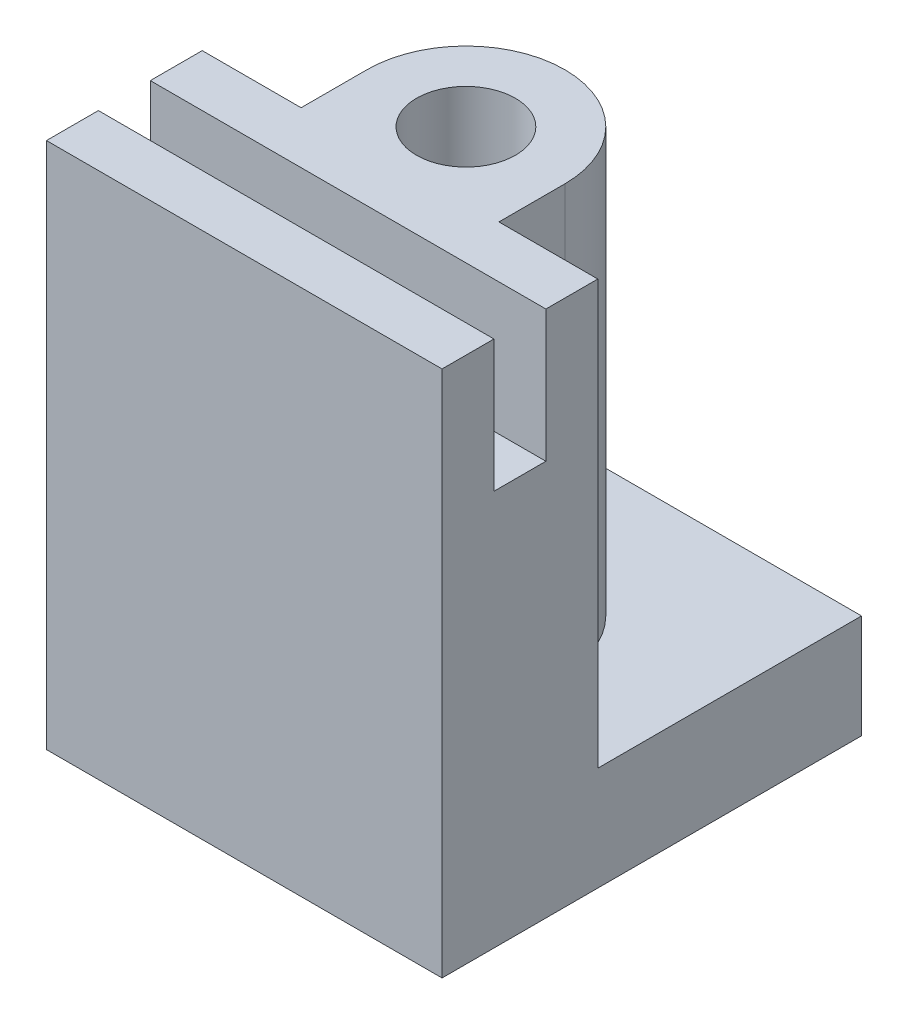
ISO-10303-21;
HEADER;
FILE_DESCRIPTION(('STEP AP214'),'2;1');
FILE_NAME('part.step','',(''),(''),'','','');
FILE_SCHEMA(('AUTOMOTIVE_DESIGN { 1 0 10303 214 1 1 1 1 }'));
ENDSEC;
DATA;
#1=APPLICATION_CONTEXT('core data for automotive mechanical design processes');
#2=APPLICATION_PROTOCOL_DEFINITION('international standard','automotive_design',2000,#1);
#3=PRODUCT_CONTEXT('',#1,'mechanical');
#4=PRODUCT('Part','Part','',(#3));
#5=PRODUCT_RELATED_PRODUCT_CATEGORY('part','',(#4));
#6=PRODUCT_DEFINITION_FORMATION('','',#4);
#7=PRODUCT_DEFINITION_CONTEXT('part definition',#1,'design');
#8=PRODUCT_DEFINITION('design','',#6,#7);
#9=PRODUCT_DEFINITION_SHAPE('','',#8);
#10=(LENGTH_UNIT() NAMED_UNIT(*) SI_UNIT(.MILLI.,.METRE.));
#11=(NAMED_UNIT(*) PLANE_ANGLE_UNIT() SI_UNIT($,.RADIAN.));
#12=(NAMED_UNIT(*) SI_UNIT($,.STERADIAN.) SOLID_ANGLE_UNIT());
#13=UNCERTAINTY_MEASURE_WITH_UNIT(LENGTH_MEASURE(1.E-05),#10,'distance_accuracy_value','');
#14=(GEOMETRIC_REPRESENTATION_CONTEXT(3) GLOBAL_UNCERTAINTY_ASSIGNED_CONTEXT((#13)) GLOBAL_UNIT_ASSIGNED_CONTEXT((#10,
#11,#12)) REPRESENTATION_CONTEXT('',''));
#15=CARTESIAN_POINT('',(0.,0.,0.));
#16=DIRECTION('',(0.,0.,1.));
#17=DIRECTION('',(1.,0.,0.));
#18=AXIS2_PLACEMENT_3D('',#15,#16,#17);
#19=CARTESIAN_POINT('',(38.1,9.99999999999999,-15.));
#20=DIRECTION('',(0.,0.,1.));
#21=DIRECTION('',(0.,-1.,0.));
#22=AXIS2_PLACEMENT_3D('',#19,#20,#21);
#23=PLANE('',#22);
#24=DIRECTION('',(-1.,0.,0.));
#25=VECTOR('',#24,1.);
#26=CARTESIAN_POINT('',(38.1,9.99999999999999,-15.));
#27=LINE('',#26,#25);
#28=CARTESIAN_POINT('',(38.1,9.99999999999999,-15.));
#29=VERTEX_POINT('',#28);
#30=CARTESIAN_POINT('',(28.575,9.99999999999998,-15.));
#31=VERTEX_POINT('',#30);
#32=EDGE_CURVE('E206',#29,#31,#27,.T.);
#33=ORIENTED_EDGE('',*,*,#32,.T.);
#34=DIRECTION('',(0.,1.,0.));
#35=VECTOR('',#34,1.);
#36=CARTESIAN_POINT('',(28.575,-0.002000000000002,-15.));
#37=LINE('',#36,#35);
#38=CARTESIAN_POINT('',(28.575,50.8,-15.));
#39=VERTEX_POINT('',#38);
#40=EDGE_CURVE('E270',#31,#39,#37,.T.);
#41=ORIENTED_EDGE('',*,*,#40,.T.);
#42=DIRECTION('',(-1.,0.,0.));
#43=VECTOR('',#42,1.);
#44=CARTESIAN_POINT('',(38.1,50.8,-15.));
#45=LINE('',#44,#43);
#46=CARTESIAN_POINT('',(38.1,50.8,-15.));
#47=VERTEX_POINT('',#46);
#48=EDGE_CURVE('E202',#47,#39,#45,.T.);
#49=ORIENTED_EDGE('',*,*,#48,.F.);
#50=DIRECTION('',(0.,1.,0.));
#51=VECTOR('',#50,1.);
#52=CARTESIAN_POINT('',(38.1,9.99999999999999,-15.));
#53=LINE('',#52,#51);
#54=EDGE_CURVE('E237',#29,#47,#53,.T.);
#55=ORIENTED_EDGE('',*,*,#54,.F.);
#56=EDGE_LOOP('',(#33,#41,#49,#55));
#57=FACE_BOUND('',#56,.T.);
#58=ADVANCED_FACE('F52',(#57),#23,.F.);
#59=CARTESIAN_POINT('',(38.1,50.8,0.));
#60=DIRECTION('',(0.,0.,-1.));
#61=DIRECTION('',(0.,1.,0.));
#62=AXIS2_PLACEMENT_3D('',#59,#60,#61);
#63=PLANE('',#62);
#64=DIRECTION('',(0.,-1.,0.));
#65=VECTOR('',#64,1.);
#66=CARTESIAN_POINT('',(0.,50.8,0.));
#67=LINE('',#66,#65);
#68=CARTESIAN_POINT('',(0.,50.8,0.));
#69=VERTEX_POINT('',#68);
#70=CARTESIAN_POINT('',(0.,0.,0.));
#71=VERTEX_POINT('',#70);
#72=EDGE_CURVE('E172',#69,#71,#67,.T.);
#73=ORIENTED_EDGE('',*,*,#72,.T.);
#74=DIRECTION('',(-1.,0.,0.));
#75=VECTOR('',#74,1.);
#76=CARTESIAN_POINT('',(38.1,0.,0.));
#77=LINE('',#76,#75);
#78=CARTESIAN_POINT('',(38.1,0.,0.));
#79=VERTEX_POINT('',#78);
#80=EDGE_CURVE('E60',#79,#71,#77,.T.);
#81=ORIENTED_EDGE('',*,*,#80,.F.);
#82=DIRECTION('',(0.,-1.,0.));
#83=VECTOR('',#82,1.);
#84=CARTESIAN_POINT('',(38.1,50.8,0.));
#85=LINE('',#84,#83);
#86=CARTESIAN_POINT('',(38.1,50.8,0.));
#87=VERTEX_POINT('',#86);
#88=EDGE_CURVE('E194',#87,#79,#85,.T.);
#89=ORIENTED_EDGE('',*,*,#88,.F.);
#90=DIRECTION('',(-1.,0.,0.));
#91=VECTOR('',#90,1.);
#92=CARTESIAN_POINT('',(38.1,50.8,0.));
#93=LINE('',#92,#91);
#94=EDGE_CURVE('E168',#87,#69,#93,.T.);
#95=ORIENTED_EDGE('',*,*,#94,.T.);
#96=EDGE_LOOP('',(#73,#81,#89,#95));
#97=FACE_BOUND('',#96,.T.);
#98=ADVANCED_FACE('F54',(#97),#63,.F.);
#99=CARTESIAN_POINT('',(38.1,0.,0.));
#100=DIRECTION('',(0.,1.,0.));
#101=DIRECTION('',(0.,0.,1.));
#102=AXIS2_PLACEMENT_3D('',#99,#100,#101);
#103=PLANE('',#102);
#104=DIRECTION('',(0.,0.,-1.));
#105=VECTOR('',#104,1.);
#106=CARTESIAN_POINT('',(0.,0.,0.));
#107=LINE('',#106,#105);
#108=CARTESIAN_POINT('',(0.,0.,-40.4));
#109=VERTEX_POINT('',#108);
#110=EDGE_CURVE('E175',#71,#109,#107,.T.);
#111=ORIENTED_EDGE('',*,*,#110,.T.);
#112=DIRECTION('',(-1.,0.,0.));
#113=VECTOR('',#112,1.);
#114=CARTESIAN_POINT('',(38.1,0.,-40.4));
#115=LINE('',#114,#113);
#116=CARTESIAN_POINT('',(38.1,0.,-40.4));
#117=VERTEX_POINT('',#116);
#118=EDGE_CURVE('E212',#117,#109,#115,.T.);
#119=ORIENTED_EDGE('',*,*,#118,.F.);
#120=DIRECTION('',(0.,0.,-1.));
#121=VECTOR('',#120,1.);
#122=CARTESIAN_POINT('',(38.1,0.,0.));
#123=LINE('',#122,#121);
#124=EDGE_CURVE('E123',#79,#117,#123,.T.);
#125=ORIENTED_EDGE('',*,*,#124,.F.);
#126=ORIENTED_EDGE('',*,*,#80,.T.);
#127=EDGE_LOOP('',(#111,#119,#125,#126));
#128=FACE_BOUND('',#127,.T.);
#129=ADVANCED_FACE('F215',(#128),#103,.F.);
#130=CARTESIAN_POINT('',(38.1,0.,-40.4));
#131=DIRECTION('',(0.,0.,1.));
#132=DIRECTION('',(1.,0.,0.));
#133=AXIS2_PLACEMENT_3D('',#130,#131,#132);
#134=PLANE('',#133);
#135=DIRECTION('',(0.,1.,0.));
#136=VECTOR('',#135,1.);
#137=CARTESIAN_POINT('',(0.,0.,-40.4));
#138=LINE('',#137,#136);
#139=CARTESIAN_POINT('',(0.,9.99999999999999,-40.4));
#140=VERTEX_POINT('',#139);
#141=EDGE_CURVE('E178',#109,#140,#138,.T.);
#142=ORIENTED_EDGE('',*,*,#141,.T.);
#143=DIRECTION('',(-1.,0.,0.));
#144=VECTOR('',#143,1.);
#145=CARTESIAN_POINT('',(38.1,9.99999999999999,-40.4));
#146=LINE('',#145,#144);
#147=CARTESIAN_POINT('',(38.1,9.99999999999999,-40.4));
#148=VERTEX_POINT('',#147);
#149=EDGE_CURVE('E209',#148,#140,#146,.T.);
#150=ORIENTED_EDGE('',*,*,#149,.F.);
#151=DIRECTION('',(0.,1.,0.));
#152=VECTOR('',#151,1.);
#153=CARTESIAN_POINT('',(38.1,0.,-40.4));
#154=LINE('',#153,#152);
#155=EDGE_CURVE('E238',#117,#148,#154,.T.);
#156=ORIENTED_EDGE('',*,*,#155,.F.);
#157=ORIENTED_EDGE('',*,*,#118,.T.);
#158=EDGE_LOOP('',(#142,#150,#156,#157));
#159=FACE_BOUND('',#158,.T.);
#160=ADVANCED_FACE('F226',(#159),#134,.F.);
#161=CARTESIAN_POINT('',(38.1,9.99999999999999,-40.4));
#162=DIRECTION('',(0.,-1.,0.));
#163=DIRECTION('',(0.,0.,-1.));
#164=AXIS2_PLACEMENT_3D('',#161,#162,#163);
#165=PLANE('',#164);
#166=CARTESIAN_POINT('',(19.05,9.99999999999999,-21.35));
#167=DIRECTION('',(0.,-1.,0.));
#168=DIRECTION('',(0.,0.,-1.));
#169=AXIS2_PLACEMENT_3D('',#166,#167,#168);
#170=CIRCLE('',#169,9.525);
#171=CARTESIAN_POINT('',(28.575,9.99999999999998,-21.35));
#172=VERTEX_POINT('',#171);
#173=CARTESIAN_POINT('',(9.525,9.99999999999998,-21.35));
#174=VERTEX_POINT('',#173);
#175=EDGE_CURVE('E176',#172,#174,#170,.F.);
#176=ORIENTED_EDGE('',*,*,#175,.F.);
#177=DIRECTION('',(0.,0.,-1.));
#178=VECTOR('',#177,1.);
#179=CARTESIAN_POINT('',(28.575,9.99999999999999,-15.));
#180=LINE('',#179,#178);
#181=EDGE_CURVE('E260',#31,#172,#180,.T.);
#182=ORIENTED_EDGE('',*,*,#181,.F.);
#183=ORIENTED_EDGE('',*,*,#32,.F.);
#184=DIRECTION('',(0.,0.,1.));
#185=VECTOR('',#184,1.);
#186=CARTESIAN_POINT('',(38.1,9.99999999999999,-40.4));
#187=LINE('',#186,#185);
#188=EDGE_CURVE('E234',#148,#29,#187,.T.);
#189=ORIENTED_EDGE('',*,*,#188,.F.);
#190=ORIENTED_EDGE('',*,*,#149,.T.);
#191=DIRECTION('',(0.,0.,1.));
#192=VECTOR('',#191,1.);
#193=CARTESIAN_POINT('',(0.,9.99999999999999,-40.4));
#194=LINE('',#193,#192);
#195=CARTESIAN_POINT('',(0.,9.99999999999999,-15.));
#196=VERTEX_POINT('',#195);
#197=EDGE_CURVE('E180',#140,#196,#194,.T.);
#198=ORIENTED_EDGE('',*,*,#197,.T.);
#199=CARTESIAN_POINT('',(9.525,9.99999999999998,-15.));
#200=VERTEX_POINT('',#199);
#201=EDGE_CURVE('E205',#200,#196,#27,.T.);
#202=ORIENTED_EDGE('',*,*,#201,.F.);
#203=DIRECTION('',(0.,0.,1.));
#204=VECTOR('',#203,1.);
#205=CARTESIAN_POINT('',(9.525,9.99999999999999,-21.35));
#206=LINE('',#205,#204);
#207=EDGE_CURVE('E257',#174,#200,#206,.T.);
#208=ORIENTED_EDGE('',*,*,#207,.F.);
#209=EDGE_LOOP('',(#176,#182,#183,#189,#190,#198,#202,#208));
#210=FACE_BOUND('',#209,.T.);
#211=ADVANCED_FACE('F231',(#210),#165,.F.);
#212=CARTESIAN_POINT('',(9.52500000000001,50.8,-15.));
#213=VERTEX_POINT('',#212);
#214=CARTESIAN_POINT('',(0.,50.8,-15.));
#215=VERTEX_POINT('',#214);
#216=EDGE_CURVE('E201',#213,#215,#45,.T.);
#217=ORIENTED_EDGE('',*,*,#216,.F.);
#218=DIRECTION('',(0.,1.,0.));
#219=VECTOR('',#218,1.);
#220=CARTESIAN_POINT('',(9.525,-0.002000000000002,-15.));
#221=LINE('',#220,#219);
#222=EDGE_CURVE('E268',#200,#213,#221,.T.);
#223=ORIENTED_EDGE('',*,*,#222,.F.);
#224=ORIENTED_EDGE('',*,*,#201,.T.);
#225=DIRECTION('',(0.,1.,0.));
#226=VECTOR('',#225,1.);
#227=CARTESIAN_POINT('',(0.,9.99999999999999,-15.));
#228=LINE('',#227,#226);
#229=EDGE_CURVE('E183',#196,#215,#228,.T.);
#230=ORIENTED_EDGE('',*,*,#229,.T.);
#231=EDGE_LOOP('',(#217,#223,#224,#230));
#232=FACE_BOUND('',#231,.T.);
#233=ADVANCED_FACE('F289',(#232),#23,.F.);
#234=CARTESIAN_POINT('',(38.1,50.8,-15.));
#235=DIRECTION('',(0.,-1.,0.));
#236=DIRECTION('',(0.,0.,-1.));
#237=AXIS2_PLACEMENT_3D('',#234,#235,#236);
#238=PLANE('',#237);
#239=DIRECTION('',(0.,0.,1.));
#240=VECTOR('',#239,1.);
#241=CARTESIAN_POINT('',(0.,50.8,-15.));
#242=LINE('',#241,#240);
#243=CARTESIAN_POINT('',(0.,50.8,-10.));
#244=VERTEX_POINT('',#243);
#245=EDGE_CURVE('E186',#215,#244,#242,.T.);
#246=ORIENTED_EDGE('',*,*,#245,.T.);
#247=DIRECTION('',(-1.,0.,0.));
#248=VECTOR('',#247,1.);
#249=CARTESIAN_POINT('',(38.1,50.8,-10.));
#250=LINE('',#249,#248);
#251=CARTESIAN_POINT('',(38.1,50.8,-10.));
#252=VERTEX_POINT('',#251);
#253=EDGE_CURVE('E198',#252,#244,#250,.T.);
#254=ORIENTED_EDGE('',*,*,#253,.F.);
#255=DIRECTION('',(0.,0.,1.));
#256=VECTOR('',#255,1.);
#257=CARTESIAN_POINT('',(38.1,50.8,-15.));
#258=LINE('',#257,#256);
#259=EDGE_CURVE('E240',#47,#252,#258,.T.);
#260=ORIENTED_EDGE('',*,*,#259,.F.);
#261=ORIENTED_EDGE('',*,*,#48,.T.);
#262=DIRECTION('',(0.,0.,-1.));
#263=VECTOR('',#262,1.);
#264=CARTESIAN_POINT('',(28.575,50.8,-15.));
#265=LINE('',#264,#263);
#266=CARTESIAN_POINT('',(28.575,50.8,-21.35));
#267=VERTEX_POINT('',#266);
#268=EDGE_CURVE('E279',#39,#267,#265,.T.);
#269=ORIENTED_EDGE('',*,*,#268,.T.);
#270=CARTESIAN_POINT('',(19.05,50.8,-21.35));
#271=DIRECTION('',(0.,1.,0.));
#272=DIRECTION('',(0.,0.,-1.));
#273=AXIS2_PLACEMENT_3D('',#270,#271,#272);
#274=CIRCLE('',#273,9.525);
#275=CARTESIAN_POINT('',(9.525,50.8,-21.35));
#276=VERTEX_POINT('',#275);
#277=EDGE_CURVE('E277',#267,#276,#274,.T.);
#278=ORIENTED_EDGE('',*,*,#277,.T.);
#279=DIRECTION('',(0.,0.,1.));
#280=VECTOR('',#279,1.);
#281=CARTESIAN_POINT('',(9.525,50.8,-21.35));
#282=LINE('',#281,#280);
#283=EDGE_CURVE('E67',#276,#213,#282,.T.);
#284=ORIENTED_EDGE('',*,*,#283,.T.);
#285=ORIENTED_EDGE('',*,*,#216,.T.);
#286=EDGE_LOOP('',(#246,#254,#260,#261,#269,#278,#284,#285));
#287=FACE_BOUND('',#286,.T.);
#288=CARTESIAN_POINT('',(19.05,50.8,-21.35));
#289=DIRECTION('',(0.,1.,0.));
#290=DIRECTION('',(0.,0.,1.));
#291=AXIS2_PLACEMENT_3D('',#288,#289,#290);
#292=CIRCLE('',#291,4.7625);
#293=CARTESIAN_POINT('',(19.05,50.8,-16.5875));
#294=VERTEX_POINT('',#293);
#295=EDGE_CURVE('E276',#294,#294,#292,.T.);
#296=ORIENTED_EDGE('',*,*,#295,.F.);
#297=EDGE_LOOP('',(#296));
#298=FACE_BOUND('',#297,.T.);
#299=ADVANCED_FACE('F248',(#287,#298),#238,.F.);
#300=CARTESIAN_POINT('',(38.1,50.8,-10.));
#301=DIRECTION('',(0.,0.,-1.));
#302=DIRECTION('',(0.,1.,0.));
#303=AXIS2_PLACEMENT_3D('',#300,#301,#302);
#304=PLANE('',#303);
#305=DIRECTION('',(0.,-1.,0.));
#306=VECTOR('',#305,1.);
#307=CARTESIAN_POINT('',(0.,50.8,-10.));
#308=LINE('',#307,#306);
#309=CARTESIAN_POINT('',(0.,38.1,-9.99999999999999));
#310=VERTEX_POINT('',#309);
#311=EDGE_CURVE('E188',#244,#310,#308,.T.);
#312=ORIENTED_EDGE('',*,*,#311,.T.);
#313=DIRECTION('',(-1.,0.,0.));
#314=VECTOR('',#313,1.);
#315=CARTESIAN_POINT('',(38.1,38.1,-9.99999999999999));
#316=LINE('',#315,#314);
#317=CARTESIAN_POINT('',(38.1,38.1,-9.99999999999999));
#318=VERTEX_POINT('',#317);
#319=EDGE_CURVE('E163',#318,#310,#316,.T.);
#320=ORIENTED_EDGE('',*,*,#319,.F.);
#321=DIRECTION('',(0.,-1.,0.));
#322=VECTOR('',#321,1.);
#323=CARTESIAN_POINT('',(38.1,50.8,-10.));
#324=LINE('',#323,#322);
#325=EDGE_CURVE('E151',#252,#318,#324,.T.);
#326=ORIENTED_EDGE('',*,*,#325,.F.);
#327=ORIENTED_EDGE('',*,*,#253,.T.);
#328=EDGE_LOOP('',(#312,#320,#326,#327));
#329=FACE_BOUND('',#328,.T.);
#330=ADVANCED_FACE('F253',(#329),#304,.F.);
#331=CARTESIAN_POINT('',(38.1,38.1,-9.99999999999999));
#332=DIRECTION('',(0.,-1.,0.));
#333=DIRECTION('',(0.,0.,-1.));
#334=AXIS2_PLACEMENT_3D('',#331,#332,#333);
#335=PLANE('',#334);
#336=DIRECTION('',(0.,0.,1.));
#337=VECTOR('',#336,1.);
#338=CARTESIAN_POINT('',(0.,38.1,-9.99999999999999));
#339=LINE('',#338,#337);
#340=CARTESIAN_POINT('',(0.,38.1,-4.99999999999999));
#341=VERTEX_POINT('',#340);
#342=EDGE_CURVE('E160',#310,#341,#339,.T.);
#343=ORIENTED_EDGE('',*,*,#342,.T.);
#344=DIRECTION('',(-1.,0.,0.));
#345=VECTOR('',#344,1.);
#346=CARTESIAN_POINT('',(38.1,38.1,-4.99999999999999));
#347=LINE('',#346,#345);
#348=CARTESIAN_POINT('',(38.1,38.1,-4.99999999999999));
#349=VERTEX_POINT('',#348);
#350=EDGE_CURVE('E157',#349,#341,#347,.T.);
#351=ORIENTED_EDGE('',*,*,#350,.F.);
#352=DIRECTION('',(0.,0.,1.));
#353=VECTOR('',#352,1.);
#354=CARTESIAN_POINT('',(38.1,38.1,-9.99999999999999));
#355=LINE('',#354,#353);
#356=EDGE_CURVE('E144',#318,#349,#355,.T.);
#357=ORIENTED_EDGE('',*,*,#356,.F.);
#358=ORIENTED_EDGE('',*,*,#319,.T.);
#359=EDGE_LOOP('',(#343,#351,#357,#358));
#360=FACE_BOUND('',#359,.T.);
#361=ADVANCED_FACE('F158',(#360),#335,.F.);
#362=CARTESIAN_POINT('',(38.1,38.1,-4.99999999999999));
#363=DIRECTION('',(0.,0.,1.));
#364=DIRECTION('',(0.,-1.,0.));
#365=AXIS2_PLACEMENT_3D('',#362,#363,#364);
#366=PLANE('',#365);
#367=DIRECTION('',(0.,1.,0.));
#368=VECTOR('',#367,1.);
#369=CARTESIAN_POINT('',(0.,38.1,-4.99999999999999));
#370=LINE('',#369,#368);
#371=CARTESIAN_POINT('',(0.,50.8,-4.99999999999999));
#372=VERTEX_POINT('',#371);
#373=EDGE_CURVE('E191',#341,#372,#370,.T.);
#374=ORIENTED_EDGE('',*,*,#373,.T.);
#375=DIRECTION('',(-1.,0.,0.));
#376=VECTOR('',#375,1.);
#377=CARTESIAN_POINT('',(38.1,50.8,-4.99999999999999));
#378=LINE('',#377,#376);
#379=CARTESIAN_POINT('',(38.1,50.8,-4.99999999999999));
#380=VERTEX_POINT('',#379);
#381=EDGE_CURVE('E164',#380,#372,#378,.T.);
#382=ORIENTED_EDGE('',*,*,#381,.F.);
#383=DIRECTION('',(0.,1.,0.));
#384=VECTOR('',#383,1.);
#385=CARTESIAN_POINT('',(38.1,38.1,-4.99999999999999));
#386=LINE('',#385,#384);
#387=EDGE_CURVE('E148',#349,#380,#386,.T.);
#388=ORIENTED_EDGE('',*,*,#387,.F.);
#389=ORIENTED_EDGE('',*,*,#350,.T.);
#390=EDGE_LOOP('',(#374,#382,#388,#389));
#391=FACE_BOUND('',#390,.T.);
#392=ADVANCED_FACE('F166',(#391),#366,.F.);
#393=CARTESIAN_POINT('',(38.1,50.8,-4.99999999999999));
#394=DIRECTION('',(0.,-1.,0.));
#395=DIRECTION('',(0.,0.,-1.));
#396=AXIS2_PLACEMENT_3D('',#393,#394,#395);
#397=PLANE('',#396);
#398=DIRECTION('',(0.,0.,1.));
#399=VECTOR('',#398,1.);
#400=CARTESIAN_POINT('',(0.,50.8,-4.99999999999999));
#401=LINE('',#400,#399);
#402=EDGE_CURVE('E114',#372,#69,#401,.T.);
#403=ORIENTED_EDGE('',*,*,#402,.T.);
#404=ORIENTED_EDGE('',*,*,#94,.F.);
#405=DIRECTION('',(0.,0.,1.));
#406=VECTOR('',#405,1.);
#407=CARTESIAN_POINT('',(38.1,50.8,-4.99999999999999));
#408=LINE('',#407,#406);
#409=EDGE_CURVE('E76',#380,#87,#408,.T.);
#410=ORIENTED_EDGE('',*,*,#409,.F.);
#411=ORIENTED_EDGE('',*,*,#381,.T.);
#412=EDGE_LOOP('',(#403,#404,#410,#411));
#413=FACE_BOUND('',#412,.T.);
#414=ADVANCED_FACE('F254',(#413),#397,.F.);
#415=CARTESIAN_POINT('',(38.1,0.,0.));
#416=DIRECTION('',(1.,0.,0.));
#417=DIRECTION('',(0.,0.,-1.));
#418=AXIS2_PLACEMENT_3D('',#415,#416,#417);
#419=PLANE('',#418);
#420=ORIENTED_EDGE('',*,*,#88,.T.);
#421=ORIENTED_EDGE('',*,*,#124,.T.);
#422=ORIENTED_EDGE('',*,*,#155,.T.);
#423=ORIENTED_EDGE('',*,*,#188,.T.);
#424=ORIENTED_EDGE('',*,*,#54,.T.);
#425=ORIENTED_EDGE('',*,*,#259,.T.);
#426=ORIENTED_EDGE('',*,*,#325,.T.);
#427=ORIENTED_EDGE('',*,*,#356,.T.);
#428=ORIENTED_EDGE('',*,*,#387,.T.);
#429=ORIENTED_EDGE('',*,*,#409,.T.);
#430=EDGE_LOOP('',(#420,#421,#422,#423,#424,#425,#426,#427,#428,#429));
#431=FACE_BOUND('',#430,.T.);
#432=ADVANCED_FACE('F146',(#431),#419,.T.);
#433=CARTESIAN_POINT('',(0.,0.,0.));
#434=DIRECTION('',(1.,0.,0.));
#435=DIRECTION('',(0.,0.,-1.));
#436=AXIS2_PLACEMENT_3D('',#433,#434,#435);
#437=PLANE('',#436);
#438=ORIENTED_EDGE('',*,*,#72,.F.);
#439=ORIENTED_EDGE('',*,*,#402,.F.);
#440=ORIENTED_EDGE('',*,*,#373,.F.);
#441=ORIENTED_EDGE('',*,*,#342,.F.);
#442=ORIENTED_EDGE('',*,*,#311,.F.);
#443=ORIENTED_EDGE('',*,*,#245,.F.);
#444=ORIENTED_EDGE('',*,*,#229,.F.);
#445=ORIENTED_EDGE('',*,*,#197,.F.);
#446=ORIENTED_EDGE('',*,*,#141,.F.);
#447=ORIENTED_EDGE('',*,*,#110,.F.);
#448=EDGE_LOOP('',(#438,#439,#440,#441,#442,#443,#444,#445,#446,#447));
#449=FACE_BOUND('',#448,.T.);
#450=ADVANCED_FACE('F220',(#449),#437,.F.);
#451=CARTESIAN_POINT('',(28.575,-0.002000000000002,-15.));
#452=DIRECTION('',(1.,0.,0.));
#453=DIRECTION('',(0.,0.,-1.));
#454=AXIS2_PLACEMENT_3D('',#451,#452,#453);
#455=PLANE('',#454);
#456=ORIENTED_EDGE('',*,*,#40,.F.);
#457=ORIENTED_EDGE('',*,*,#181,.T.);
#458=DIRECTION('',(0.,1.,0.));
#459=VECTOR('',#458,1.);
#460=CARTESIAN_POINT('',(28.575,-0.002000000000002,-21.35));
#461=LINE('',#460,#459);
#462=EDGE_CURVE('E273',#172,#267,#461,.T.);
#463=ORIENTED_EDGE('',*,*,#462,.T.);
#464=ORIENTED_EDGE('',*,*,#268,.F.);
#465=EDGE_LOOP('',(#456,#457,#463,#464));
#466=FACE_BOUND('',#465,.T.);
#467=ADVANCED_FACE('F366',(#466),#455,.T.);
#468=CARTESIAN_POINT('',(9.525,-0.002000000000002,-21.35));
#469=DIRECTION('',(-1.,0.,0.));
#470=DIRECTION('',(0.,0.,1.));
#471=AXIS2_PLACEMENT_3D('',#468,#469,#470);
#472=PLANE('',#471);
#473=DIRECTION('',(0.,1.,0.));
#474=VECTOR('',#473,1.);
#475=CARTESIAN_POINT('',(9.525,-0.002000000000002,-21.35));
#476=LINE('',#475,#474);
#477=EDGE_CURVE('E265',#174,#276,#476,.T.);
#478=ORIENTED_EDGE('',*,*,#477,.F.);
#479=ORIENTED_EDGE('',*,*,#207,.T.);
#480=ORIENTED_EDGE('',*,*,#222,.T.);
#481=ORIENTED_EDGE('',*,*,#283,.F.);
#482=EDGE_LOOP('',(#478,#479,#480,#481));
#483=FACE_BOUND('',#482,.T.);
#484=ADVANCED_FACE('F392',(#483),#472,.T.);
#485=CARTESIAN_POINT('',(19.05,-0.002000000000002,-21.35));
#486=DIRECTION('',(0.,1.,0.));
#487=DIRECTION('',(0.,0.,1.));
#488=AXIS2_PLACEMENT_3D('',#485,#486,#487);
#489=CYLINDRICAL_SURFACE('',#488,9.525);
#490=ORIENTED_EDGE('',*,*,#462,.F.);
#491=ORIENTED_EDGE('',*,*,#175,.T.);
#492=ORIENTED_EDGE('',*,*,#477,.T.);
#493=ORIENTED_EDGE('',*,*,#277,.F.);
#494=EDGE_LOOP('',(#490,#491,#492,#493));
#495=FACE_BOUND('',#494,.T.);
#496=ADVANCED_FACE('F401',(#495),#489,.T.);
#497=CARTESIAN_POINT('',(19.05,-0.002000000000002,-21.35));
#498=DIRECTION('',(0.,1.,0.));
#499=DIRECTION('',(0.,0.,1.));
#500=AXIS2_PLACEMENT_3D('',#497,#498,#499);
#501=CYLINDRICAL_SURFACE('',#500,4.7625);
#502=ORIENTED_EDGE('',*,*,#295,.T.);
#503=EDGE_LOOP('',(#502));
#504=FACE_BOUND('',#503,.T.);
#505=CARTESIAN_POINT('',(19.05,9.99999999999999,-21.35));
#506=DIRECTION('',(0.,-1.,0.));
#507=DIRECTION('',(0.,0.,-1.));
#508=AXIS2_PLACEMENT_3D('',#505,#506,#507);
#509=CIRCLE('',#508,4.7625);
#510=CARTESIAN_POINT('',(19.05,9.99999999999999,-26.1125));
#511=VERTEX_POINT('',#510);
#512=EDGE_CURVE('E12',#511,#511,#509,.T.);
#513=ORIENTED_EDGE('',*,*,#512,.T.);
#514=EDGE_LOOP('',(#513));
#515=FACE_BOUND('',#514,.T.);
#516=ADVANCED_FACE('F286',(#504,#515),#501,.F.);
#517=ORIENTED_EDGE('',*,*,#512,.F.);
#518=EDGE_LOOP('',(#517));
#519=FACE_BOUND('',#518,.T.);
#520=ADVANCED_FACE('F309',(#519),#165,.F.);
#521=CLOSED_SHELL('',(#58,#98,#129,#160,#211,#233,#299,#330,#361,#392,#414,#432,#450,#467,#484,
#496,#516,#520));
#522=MANIFOLD_SOLID_BREP('B2',#521);
#523=ADVANCED_BREP_SHAPE_REPRESENTATION('',(#18,#522),#14);
#524=SHAPE_DEFINITION_REPRESENTATION(#9,#523);
ENDSEC;
END-ISO-10303-21;
